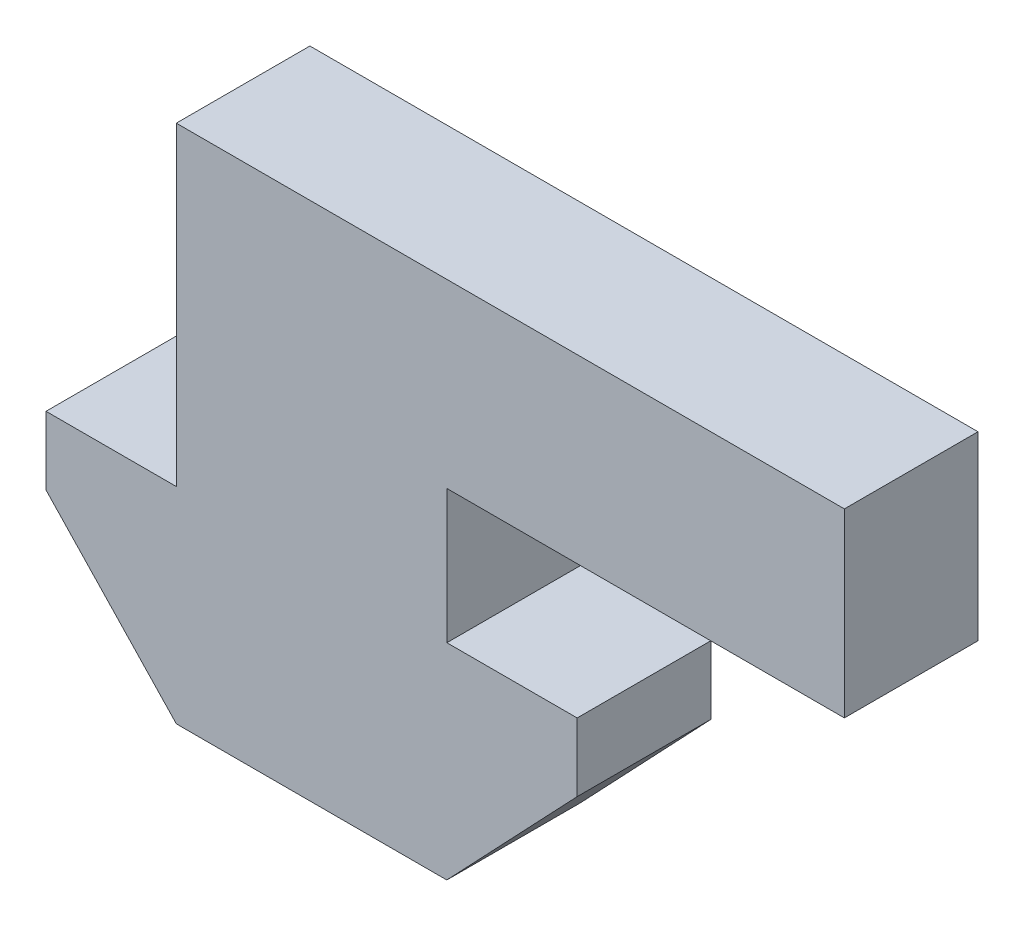
ISO-10303-21;
HEADER;
FILE_DESCRIPTION(('STEP AP214'),'2;1');
FILE_NAME('part.step','',(''),(''),'','','');
FILE_SCHEMA(('AUTOMOTIVE_DESIGN { 1 0 10303 214 1 1 1 1 }'));
ENDSEC;
DATA;
#1=APPLICATION_CONTEXT('core data for automotive mechanical design processes');
#2=APPLICATION_PROTOCOL_DEFINITION('international standard','automotive_design',2000,#1);
#3=PRODUCT_CONTEXT('',#1,'mechanical');
#4=PRODUCT('Part','Part','',(#3));
#5=PRODUCT_RELATED_PRODUCT_CATEGORY('part','',(#4));
#6=PRODUCT_DEFINITION_FORMATION('','',#4);
#7=PRODUCT_DEFINITION_CONTEXT('part definition',#1,'design');
#8=PRODUCT_DEFINITION('design','',#6,#7);
#9=PRODUCT_DEFINITION_SHAPE('','',#8);
#10=(LENGTH_UNIT() NAMED_UNIT(*) SI_UNIT(.MILLI.,.METRE.));
#11=(NAMED_UNIT(*) PLANE_ANGLE_UNIT() SI_UNIT($,.RADIAN.));
#12=(NAMED_UNIT(*) SI_UNIT($,.STERADIAN.) SOLID_ANGLE_UNIT());
#13=UNCERTAINTY_MEASURE_WITH_UNIT(LENGTH_MEASURE(1.E-05),#10,'distance_accuracy_value','');
#14=(GEOMETRIC_REPRESENTATION_CONTEXT(3) GLOBAL_UNCERTAINTY_ASSIGNED_CONTEXT((#13)) GLOBAL_UNIT_ASSIGNED_CONTEXT((#10,
#11,#12)) REPRESENTATION_CONTEXT('',''));
#15=CARTESIAN_POINT('',(0.,0.,0.));
#16=DIRECTION('',(0.,0.,1.));
#17=DIRECTION('',(1.,0.,0.));
#18=AXIS2_PLACEMENT_3D('',#15,#16,#17);
#19=CARTESIAN_POINT('',(-7.95,0.,4.));
#20=DIRECTION('',(-1.,0.,0.));
#21=DIRECTION('',(0.,-1.,0.));
#22=AXIS2_PLACEMENT_3D('',#19,#20,#21);
#23=PLANE('',#22);
#24=DIRECTION('',(0.,1.,0.));
#25=VECTOR('',#24,1.);
#26=CARTESIAN_POINT('',(-7.95,0.,0.));
#27=LINE('',#26,#25);
#28=CARTESIAN_POINT('',(-7.95,-2.04,0.));
#29=VERTEX_POINT('',#28);
#30=CARTESIAN_POINT('',(-7.95,0.,0.));
#31=VERTEX_POINT('',#30);
#32=EDGE_CURVE('E168',#29,#31,#27,.T.);
#33=ORIENTED_EDGE('',*,*,#32,.F.);
#34=DIRECTION('',(0.,0.,-1.));
#35=VECTOR('',#34,1.);
#36=CARTESIAN_POINT('',(-7.95,-2.04,4.));
#37=LINE('',#36,#35);
#38=CARTESIAN_POINT('',(-7.95,-2.04,4.));
#39=VERTEX_POINT('',#38);
#40=EDGE_CURVE('E11',#39,#29,#37,.T.);
#41=ORIENTED_EDGE('',*,*,#40,.F.);
#42=DIRECTION('',(0.,1.,0.));
#43=VECTOR('',#42,1.);
#44=CARTESIAN_POINT('',(-7.95,0.,4.));
#45=LINE('',#44,#43);
#46=CARTESIAN_POINT('',(-7.95,0.,4.));
#47=VERTEX_POINT('',#46);
#48=EDGE_CURVE('E262',#39,#47,#45,.T.);
#49=ORIENTED_EDGE('',*,*,#48,.T.);
#50=DIRECTION('',(0.,0.,-1.));
#51=VECTOR('',#50,1.);
#52=CARTESIAN_POINT('',(-7.95,0.,4.));
#53=LINE('',#52,#51);
#54=EDGE_CURVE('E62',#47,#31,#53,.T.);
#55=ORIENTED_EDGE('',*,*,#54,.T.);
#56=EDGE_LOOP('',(#33,#41,#49,#55));
#57=FACE_BOUND('',#56,.T.);
#58=ADVANCED_FACE('F45',(#57),#23,.T.);
#59=CARTESIAN_POINT('',(-5.20217481392665,-4.93600140143796,4.));
#60=DIRECTION('',(-0.725421588273713,-0.688304815664138,0.));
#61=DIRECTION('',(0.688304815664138,-0.725421588273713,0.));
#62=AXIS2_PLACEMENT_3D('',#59,#60,#61);
#63=PLANE('',#62);
#64=DIRECTION('',(-0.688304815664138,0.725421588273713,0.));
#65=VECTOR('',#64,1.);
#66=CARTESIAN_POINT('',(-5.20217481392665,-4.93600140143796,0.));
#67=LINE('',#66,#65);
#68=CARTESIAN_POINT('',(-4.048,-6.15241498392368,0.));
#69=VERTEX_POINT('',#68);
#70=EDGE_CURVE('E171',#69,#29,#67,.T.);
#71=ORIENTED_EDGE('',*,*,#70,.F.);
#72=DIRECTION('',(0.,0.,-1.));
#73=VECTOR('',#72,1.);
#74=CARTESIAN_POINT('',(-4.048,-6.15241498392368,4.));
#75=LINE('',#74,#73);
#76=CARTESIAN_POINT('',(-4.048,-6.15241498392368,4.));
#77=VERTEX_POINT('',#76);
#78=EDGE_CURVE('E54',#77,#69,#75,.T.);
#79=ORIENTED_EDGE('',*,*,#78,.F.);
#80=DIRECTION('',(-0.688304815664138,0.725421588273713,0.));
#81=VECTOR('',#80,1.);
#82=CARTESIAN_POINT('',(-5.20217481392665,-4.93600140143796,4.));
#83=LINE('',#82,#81);
#84=EDGE_CURVE('E255',#77,#39,#83,.T.);
#85=ORIENTED_EDGE('',*,*,#84,.T.);
#86=ORIENTED_EDGE('',*,*,#40,.T.);
#87=EDGE_LOOP('',(#71,#79,#85,#86));
#88=FACE_BOUND('',#87,.T.);
#89=ADVANCED_FACE('F243',(#88),#63,.T.);
#90=CARTESIAN_POINT('',(0.,-6.15241498392368,4.));
#91=DIRECTION('',(0.,-1.,0.));
#92=DIRECTION('',(1.,0.,0.));
#93=AXIS2_PLACEMENT_3D('',#90,#91,#92);
#94=PLANE('',#93);
#95=DIRECTION('',(-1.,0.,0.));
#96=VECTOR('',#95,1.);
#97=CARTESIAN_POINT('',(0.,-6.15241498392368,0.));
#98=LINE('',#97,#96);
#99=CARTESIAN_POINT('',(4.048,-6.15241498392368,0.));
#100=VERTEX_POINT('',#99);
#101=EDGE_CURVE('E175',#100,#69,#98,.T.);
#102=ORIENTED_EDGE('',*,*,#101,.F.);
#103=DIRECTION('',(0.,0.,-1.));
#104=VECTOR('',#103,1.);
#105=CARTESIAN_POINT('',(4.048,-6.15241498392368,4.));
#106=LINE('',#105,#104);
#107=CARTESIAN_POINT('',(4.048,-6.15241498392368,4.));
#108=VERTEX_POINT('',#107);
#109=EDGE_CURVE('E230',#108,#100,#106,.T.);
#110=ORIENTED_EDGE('',*,*,#109,.F.);
#111=DIRECTION('',(-1.,0.,0.));
#112=VECTOR('',#111,1.);
#113=CARTESIAN_POINT('',(0.,-6.15241498392368,4.));
#114=LINE('',#113,#112);
#115=EDGE_CURVE('E239',#108,#77,#114,.T.);
#116=ORIENTED_EDGE('',*,*,#115,.T.);
#117=ORIENTED_EDGE('',*,*,#78,.T.);
#118=EDGE_LOOP('',(#102,#110,#116,#117));
#119=FACE_BOUND('',#118,.T.);
#120=ADVANCED_FACE('F237',(#119),#94,.T.);
#121=CARTESIAN_POINT('',(5.20217481392665,-4.93600140143796,4.));
#122=DIRECTION('',(0.725421588273714,-0.688304815664138,0.));
#123=DIRECTION('',(0.688304815664138,0.725421588273714,0.));
#124=AXIS2_PLACEMENT_3D('',#121,#122,#123);
#125=PLANE('',#124);
#126=DIRECTION('',(-0.688304815664138,-0.725421588273714,0.));
#127=VECTOR('',#126,1.);
#128=CARTESIAN_POINT('',(5.20217481392665,-4.93600140143796,0.));
#129=LINE('',#128,#127);
#130=CARTESIAN_POINT('',(7.95,-2.04,0.));
#131=VERTEX_POINT('',#130);
#132=EDGE_CURVE('E179',#131,#100,#129,.T.);
#133=ORIENTED_EDGE('',*,*,#132,.F.);
#134=DIRECTION('',(0.,0.,-1.));
#135=VECTOR('',#134,1.);
#136=CARTESIAN_POINT('',(7.95,-2.04,4.));
#137=LINE('',#136,#135);
#138=CARTESIAN_POINT('',(7.95,-2.04,4.));
#139=VERTEX_POINT('',#138);
#140=EDGE_CURVE('E227',#139,#131,#137,.T.);
#141=ORIENTED_EDGE('',*,*,#140,.F.);
#142=DIRECTION('',(-0.688304815664138,-0.725421588273714,0.));
#143=VECTOR('',#142,1.);
#144=CARTESIAN_POINT('',(5.20217481392665,-4.93600140143796,4.));
#145=LINE('',#144,#143);
#146=EDGE_CURVE('E252',#139,#108,#145,.T.);
#147=ORIENTED_EDGE('',*,*,#146,.T.);
#148=ORIENTED_EDGE('',*,*,#109,.T.);
#149=EDGE_LOOP('',(#133,#141,#147,#148));
#150=FACE_BOUND('',#149,.T.);
#151=ADVANCED_FACE('F249',(#150),#125,.T.);
#152=CARTESIAN_POINT('',(7.95,0.,4.));
#153=DIRECTION('',(1.,0.,0.));
#154=DIRECTION('',(0.,1.,0.));
#155=AXIS2_PLACEMENT_3D('',#152,#153,#154);
#156=PLANE('',#155);
#157=DIRECTION('',(0.,-1.,0.));
#158=VECTOR('',#157,1.);
#159=CARTESIAN_POINT('',(7.95,0.,0.));
#160=LINE('',#159,#158);
#161=CARTESIAN_POINT('',(7.95,0.,0.));
#162=VERTEX_POINT('',#161);
#163=EDGE_CURVE('E183',#162,#131,#160,.T.);
#164=ORIENTED_EDGE('',*,*,#163,.F.);
#165=DIRECTION('',(0.,0.,-1.));
#166=VECTOR('',#165,1.);
#167=CARTESIAN_POINT('',(7.95,0.,4.));
#168=LINE('',#167,#166);
#169=CARTESIAN_POINT('',(7.95,0.,4.));
#170=VERTEX_POINT('',#169);
#171=EDGE_CURVE('E224',#170,#162,#168,.T.);
#172=ORIENTED_EDGE('',*,*,#171,.F.);
#173=DIRECTION('',(0.,-1.,0.));
#174=VECTOR('',#173,1.);
#175=CARTESIAN_POINT('',(7.95,0.,4.));
#176=LINE('',#175,#174);
#177=EDGE_CURVE('E260',#170,#139,#176,.T.);
#178=ORIENTED_EDGE('',*,*,#177,.T.);
#179=ORIENTED_EDGE('',*,*,#140,.T.);
#180=EDGE_LOOP('',(#164,#172,#178,#179));
#181=FACE_BOUND('',#180,.T.);
#182=ADVANCED_FACE('F298',(#181),#156,.T.);
#183=CARTESIAN_POINT('',(0.,0.,4.));
#184=DIRECTION('',(0.,1.,0.));
#185=DIRECTION('',(-1.,0.,0.));
#186=AXIS2_PLACEMENT_3D('',#183,#184,#185);
#187=PLANE('',#186);
#188=DIRECTION('',(1.,0.,0.));
#189=VECTOR('',#188,1.);
#190=CARTESIAN_POINT('',(0.,0.,0.));
#191=LINE('',#190,#189);
#192=CARTESIAN_POINT('',(4.05,0.,0.));
#193=VERTEX_POINT('',#192);
#194=EDGE_CURVE('E187',#193,#162,#191,.T.);
#195=ORIENTED_EDGE('',*,*,#194,.F.);
#196=DIRECTION('',(0.,0.,-1.));
#197=VECTOR('',#196,1.);
#198=CARTESIAN_POINT('',(4.05,0.,4.));
#199=LINE('',#198,#197);
#200=CARTESIAN_POINT('',(4.05,0.,4.));
#201=VERTEX_POINT('',#200);
#202=EDGE_CURVE('E221',#201,#193,#199,.T.);
#203=ORIENTED_EDGE('',*,*,#202,.F.);
#204=DIRECTION('',(1.,0.,0.));
#205=VECTOR('',#204,1.);
#206=CARTESIAN_POINT('',(0.,0.,4.));
#207=LINE('',#206,#205);
#208=EDGE_CURVE('E165',#201,#170,#207,.T.);
#209=ORIENTED_EDGE('',*,*,#208,.T.);
#210=ORIENTED_EDGE('',*,*,#171,.T.);
#211=EDGE_LOOP('',(#195,#203,#209,#210));
#212=FACE_BOUND('',#211,.T.);
#213=ADVANCED_FACE('F288',(#212),#187,.T.);
#214=CARTESIAN_POINT('',(4.05,0.,4.));
#215=DIRECTION('',(1.,0.,0.));
#216=DIRECTION('',(0.,1.,0.));
#217=AXIS2_PLACEMENT_3D('',#214,#215,#216);
#218=PLANE('',#217);
#219=DIRECTION('',(0.,-1.,0.));
#220=VECTOR('',#219,1.);
#221=CARTESIAN_POINT('',(4.05,0.,0.));
#222=LINE('',#221,#220);
#223=CARTESIAN_POINT('',(4.05,4.,0.));
#224=VERTEX_POINT('',#223);
#225=EDGE_CURVE('E191',#224,#193,#222,.T.);
#226=ORIENTED_EDGE('',*,*,#225,.F.);
#227=DIRECTION('',(0.,0.,-1.));
#228=VECTOR('',#227,1.);
#229=CARTESIAN_POINT('',(4.05,4.,4.));
#230=LINE('',#229,#228);
#231=CARTESIAN_POINT('',(4.05,4.,4.));
#232=VERTEX_POINT('',#231);
#233=EDGE_CURVE('E218',#232,#224,#230,.T.);
#234=ORIENTED_EDGE('',*,*,#233,.F.);
#235=DIRECTION('',(0.,-1.,0.));
#236=VECTOR('',#235,1.);
#237=CARTESIAN_POINT('',(4.05,0.,4.));
#238=LINE('',#237,#236);
#239=EDGE_CURVE('E270',#232,#201,#238,.T.);
#240=ORIENTED_EDGE('',*,*,#239,.T.);
#241=ORIENTED_EDGE('',*,*,#202,.T.);
#242=EDGE_LOOP('',(#226,#234,#240,#241));
#243=FACE_BOUND('',#242,.T.);
#244=ADVANCED_FACE('F297',(#243),#218,.T.);
#245=CARTESIAN_POINT('',(0.,4.,4.));
#246=DIRECTION('',(0.,-1.,0.));
#247=DIRECTION('',(1.,0.,0.));
#248=AXIS2_PLACEMENT_3D('',#245,#246,#247);
#249=PLANE('',#248);
#250=DIRECTION('',(-1.,0.,0.));
#251=VECTOR('',#250,1.);
#252=CARTESIAN_POINT('',(0.,4.,0.));
#253=LINE('',#252,#251);
#254=CARTESIAN_POINT('',(15.95,4.,0.));
#255=VERTEX_POINT('',#254);
#256=EDGE_CURVE('E196',#255,#224,#253,.T.);
#257=ORIENTED_EDGE('',*,*,#256,.F.);
#258=DIRECTION('',(0.,0.,-1.));
#259=VECTOR('',#258,1.);
#260=CARTESIAN_POINT('',(15.95,4.,4.));
#261=LINE('',#260,#259);
#262=CARTESIAN_POINT('',(15.95,4.,4.));
#263=VERTEX_POINT('',#262);
#264=EDGE_CURVE('E215',#263,#255,#261,.T.);
#265=ORIENTED_EDGE('',*,*,#264,.F.);
#266=DIRECTION('',(-1.,0.,0.));
#267=VECTOR('',#266,1.);
#268=CARTESIAN_POINT('',(0.,4.,4.));
#269=LINE('',#268,#267);
#270=EDGE_CURVE('E274',#263,#232,#269,.T.);
#271=ORIENTED_EDGE('',*,*,#270,.T.);
#272=ORIENTED_EDGE('',*,*,#233,.T.);
#273=EDGE_LOOP('',(#257,#265,#271,#272));
#274=FACE_BOUND('',#273,.T.);
#275=ADVANCED_FACE('F316',(#274),#249,.T.);
#276=CARTESIAN_POINT('',(15.95,0.,4.));
#277=DIRECTION('',(1.,0.,0.));
#278=DIRECTION('',(0.,0.,-1.));
#279=AXIS2_PLACEMENT_3D('',#276,#277,#278);
#280=PLANE('',#279);
#281=DIRECTION('',(0.,-1.,0.));
#282=VECTOR('',#281,1.);
#283=CARTESIAN_POINT('',(15.95,0.,0.));
#284=LINE('',#283,#282);
#285=CARTESIAN_POINT('',(15.95,9.42,0.));
#286=VERTEX_POINT('',#285);
#287=EDGE_CURVE('E200',#286,#255,#284,.T.);
#288=ORIENTED_EDGE('',*,*,#287,.F.);
#289=DIRECTION('',(0.,0.,-1.));
#290=VECTOR('',#289,1.);
#291=CARTESIAN_POINT('',(15.95,9.42,4.));
#292=LINE('',#291,#290);
#293=CARTESIAN_POINT('',(15.95,9.42,4.));
#294=VERTEX_POINT('',#293);
#295=EDGE_CURVE('E146',#294,#286,#292,.T.);
#296=ORIENTED_EDGE('',*,*,#295,.F.);
#297=DIRECTION('',(0.,-1.,0.));
#298=VECTOR('',#297,1.);
#299=CARTESIAN_POINT('',(15.95,0.,4.));
#300=LINE('',#299,#298);
#301=EDGE_CURVE('E156',#294,#263,#300,.T.);
#302=ORIENTED_EDGE('',*,*,#301,.T.);
#303=ORIENTED_EDGE('',*,*,#264,.T.);
#304=EDGE_LOOP('',(#288,#296,#302,#303));
#305=FACE_BOUND('',#304,.T.);
#306=ADVANCED_FACE('F280',(#305),#280,.T.);
#307=CARTESIAN_POINT('',(0.,9.42,4.));
#308=DIRECTION('',(0.,1.,0.));
#309=DIRECTION('',(0.,0.,1.));
#310=AXIS2_PLACEMENT_3D('',#307,#308,#309);
#311=PLANE('',#310);
#312=DIRECTION('',(1.,0.,0.));
#313=VECTOR('',#312,1.);
#314=CARTESIAN_POINT('',(0.,9.42,0.));
#315=LINE('',#314,#313);
#316=CARTESIAN_POINT('',(-4.05,9.42,0.));
#317=VERTEX_POINT('',#316);
#318=EDGE_CURVE('E141',#317,#286,#315,.T.);
#319=ORIENTED_EDGE('',*,*,#318,.F.);
#320=DIRECTION('',(0.,0.,-1.));
#321=VECTOR('',#320,1.);
#322=CARTESIAN_POINT('',(-4.05,9.42,4.));
#323=LINE('',#322,#321);
#324=CARTESIAN_POINT('',(-4.05,9.42,4.));
#325=VERTEX_POINT('',#324);
#326=EDGE_CURVE('E136',#325,#317,#323,.T.);
#327=ORIENTED_EDGE('',*,*,#326,.F.);
#328=DIRECTION('',(1.,0.,0.));
#329=VECTOR('',#328,1.);
#330=CARTESIAN_POINT('',(0.,9.42,4.));
#331=LINE('',#330,#329);
#332=EDGE_CURVE('E139',#325,#294,#331,.T.);
#333=ORIENTED_EDGE('',*,*,#332,.T.);
#334=ORIENTED_EDGE('',*,*,#295,.T.);
#335=EDGE_LOOP('',(#319,#327,#333,#334));
#336=FACE_BOUND('',#335,.T.);
#337=ADVANCED_FACE('F138',(#336),#311,.T.);
#338=CARTESIAN_POINT('',(-4.05,0.,4.));
#339=DIRECTION('',(-1.,0.,0.));
#340=DIRECTION('',(0.,0.,1.));
#341=AXIS2_PLACEMENT_3D('',#338,#339,#340);
#342=PLANE('',#341);
#343=DIRECTION('',(0.,1.,0.));
#344=VECTOR('',#343,1.);
#345=CARTESIAN_POINT('',(-4.05,0.,0.));
#346=LINE('',#345,#344);
#347=CARTESIAN_POINT('',(-4.05,0.,0.));
#348=VERTEX_POINT('',#347);
#349=EDGE_CURVE('E206',#348,#317,#346,.T.);
#350=ORIENTED_EDGE('',*,*,#349,.F.);
#351=DIRECTION('',(0.,0.,-1.));
#352=VECTOR('',#351,1.);
#353=CARTESIAN_POINT('',(-4.05,0.,4.));
#354=LINE('',#353,#352);
#355=CARTESIAN_POINT('',(-4.05,0.,4.));
#356=VERTEX_POINT('',#355);
#357=EDGE_CURVE('E99',#356,#348,#354,.T.);
#358=ORIENTED_EDGE('',*,*,#357,.F.);
#359=DIRECTION('',(0.,1.,0.));
#360=VECTOR('',#359,1.);
#361=CARTESIAN_POINT('',(-4.05,0.,4.));
#362=LINE('',#361,#360);
#363=EDGE_CURVE('E153',#356,#325,#362,.T.);
#364=ORIENTED_EDGE('',*,*,#363,.T.);
#365=ORIENTED_EDGE('',*,*,#326,.T.);
#366=EDGE_LOOP('',(#350,#358,#364,#365));
#367=FACE_BOUND('',#366,.T.);
#368=ADVANCED_FACE('F159',(#367),#342,.T.);
#369=EDGE_CURVE('E192',#31,#348,#191,.T.);
#370=ORIENTED_EDGE('',*,*,#369,.F.);
#371=ORIENTED_EDGE('',*,*,#54,.F.);
#372=EDGE_CURVE('E161',#47,#356,#207,.T.);
#373=ORIENTED_EDGE('',*,*,#372,.T.);
#374=ORIENTED_EDGE('',*,*,#357,.T.);
#375=EDGE_LOOP('',(#370,#371,#373,#374));
#376=FACE_BOUND('',#375,.T.);
#377=ADVANCED_FACE('F285',(#376),#187,.T.);
#378=CARTESIAN_POINT('',(0.,0.,4.));
#379=DIRECTION('',(0.,0.,1.));
#380=DIRECTION('',(1.,0.,0.));
#381=AXIS2_PLACEMENT_3D('',#378,#379,#380);
#382=PLANE('',#381);
#383=ORIENTED_EDGE('',*,*,#48,.F.);
#384=ORIENTED_EDGE('',*,*,#84,.F.);
#385=ORIENTED_EDGE('',*,*,#115,.F.);
#386=ORIENTED_EDGE('',*,*,#146,.F.);
#387=ORIENTED_EDGE('',*,*,#177,.F.);
#388=ORIENTED_EDGE('',*,*,#208,.F.);
#389=ORIENTED_EDGE('',*,*,#239,.F.);
#390=ORIENTED_EDGE('',*,*,#270,.F.);
#391=ORIENTED_EDGE('',*,*,#301,.F.);
#392=ORIENTED_EDGE('',*,*,#332,.F.);
#393=ORIENTED_EDGE('',*,*,#363,.F.);
#394=ORIENTED_EDGE('',*,*,#372,.F.);
#395=EDGE_LOOP('',(#383,#384,#385,#386,#387,#388,#389,#390,#391,#392,#393,#394));
#396=FACE_BOUND('',#395,.T.);
#397=ADVANCED_FACE('F151',(#396),#382,.T.);
#398=CARTESIAN_POINT('',(0.,0.,0.));
#399=DIRECTION('',(0.,0.,1.));
#400=DIRECTION('',(1.,0.,0.));
#401=AXIS2_PLACEMENT_3D('',#398,#399,#400);
#402=PLANE('',#401);
#403=ORIENTED_EDGE('',*,*,#32,.T.);
#404=ORIENTED_EDGE('',*,*,#369,.T.);
#405=ORIENTED_EDGE('',*,*,#349,.T.);
#406=ORIENTED_EDGE('',*,*,#318,.T.);
#407=ORIENTED_EDGE('',*,*,#287,.T.);
#408=ORIENTED_EDGE('',*,*,#256,.T.);
#409=ORIENTED_EDGE('',*,*,#225,.T.);
#410=ORIENTED_EDGE('',*,*,#194,.T.);
#411=ORIENTED_EDGE('',*,*,#163,.T.);
#412=ORIENTED_EDGE('',*,*,#132,.T.);
#413=ORIENTED_EDGE('',*,*,#101,.T.);
#414=ORIENTED_EDGE('',*,*,#70,.T.);
#415=EDGE_LOOP('',(#403,#404,#405,#406,#407,#408,#409,#410,#411,#412,#413,#414));
#416=FACE_BOUND('',#415,.T.);
#417=ADVANCED_FACE('F245',(#416),#402,.F.);
#418=CLOSED_SHELL('',(#58,#89,#120,#151,#182,#213,#244,#275,#306,#337,#368,#377,#397,#417));
#419=MANIFOLD_SOLID_BREP('B2',#418);
#420=ADVANCED_BREP_SHAPE_REPRESENTATION('',(#18,#419),#14);
#421=SHAPE_DEFINITION_REPRESENTATION(#9,#420);
ENDSEC;
END-ISO-10303-21;
